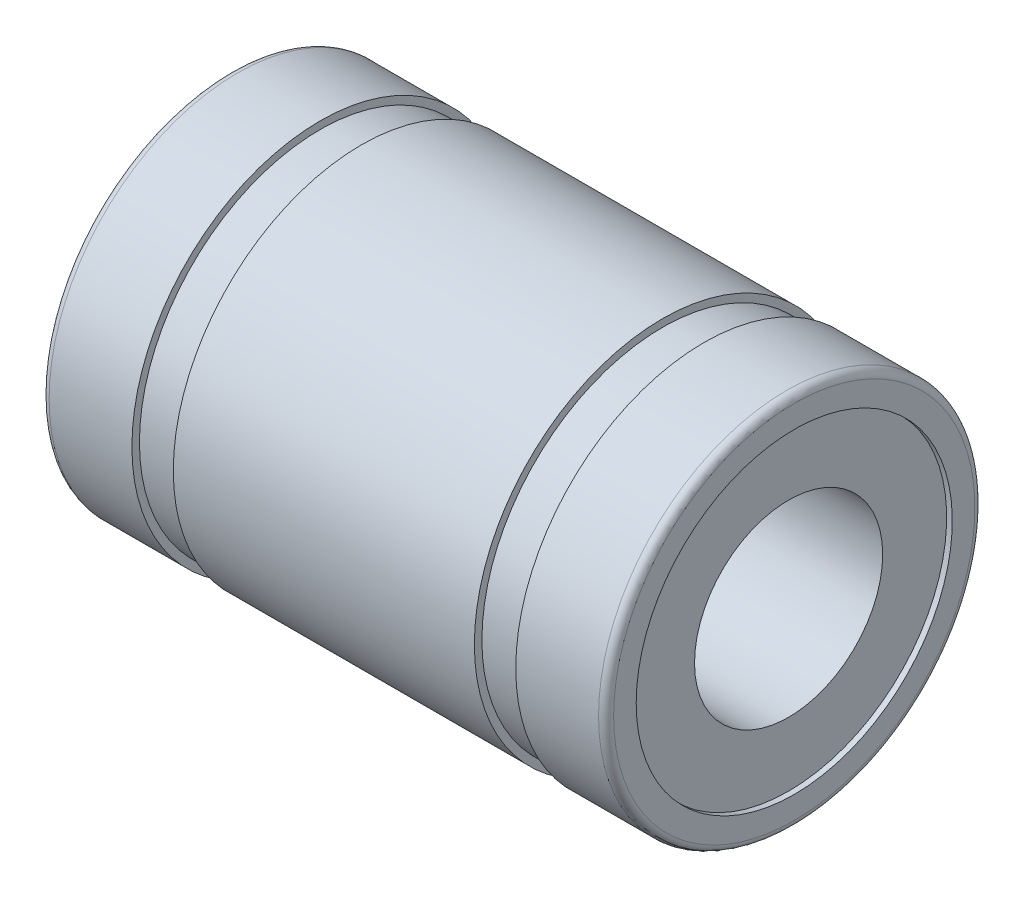
ISO-10303-21;
HEADER;
FILE_DESCRIPTION(('STEP AP214'),'2;1');
FILE_NAME('part.step','',(''),(''),'','','');
FILE_SCHEMA(('AUTOMOTIVE_DESIGN { 1 0 10303 214 1 1 1 1 }'));
ENDSEC;
DATA;
#1=APPLICATION_CONTEXT('core data for automotive mechanical design processes');
#2=APPLICATION_PROTOCOL_DEFINITION('international standard','automotive_design',2000,#1);
#3=PRODUCT_CONTEXT('',#1,'mechanical');
#4=PRODUCT('Part','Part','',(#3));
#5=PRODUCT_RELATED_PRODUCT_CATEGORY('part','',(#4));
#6=PRODUCT_DEFINITION_FORMATION('','',#4);
#7=PRODUCT_DEFINITION_CONTEXT('part definition',#1,'design');
#8=PRODUCT_DEFINITION('design','',#6,#7);
#9=PRODUCT_DEFINITION_SHAPE('','',#8);
#10=(LENGTH_UNIT() NAMED_UNIT(*) SI_UNIT(.MILLI.,.METRE.));
#11=(NAMED_UNIT(*) PLANE_ANGLE_UNIT() SI_UNIT($,.RADIAN.));
#12=(NAMED_UNIT(*) SI_UNIT($,.STERADIAN.) SOLID_ANGLE_UNIT());
#13=UNCERTAINTY_MEASURE_WITH_UNIT(LENGTH_MEASURE(1.E-05),#10,'distance_accuracy_value','');
#14=(GEOMETRIC_REPRESENTATION_CONTEXT(3) GLOBAL_UNCERTAINTY_ASSIGNED_CONTEXT((#13)) GLOBAL_UNIT_ASSIGNED_CONTEXT((#10,
#11,#12)) REPRESENTATION_CONTEXT('',''));
#15=CARTESIAN_POINT('',(0.,0.,0.));
#16=DIRECTION('',(0.,0.,1.));
#17=DIRECTION('',(1.,0.,0.));
#18=AXIS2_PLACEMENT_3D('',#15,#16,#17);
#19=CARTESIAN_POINT('',(-7.3,0.,0.));
#20=DIRECTION('',(-1.,0.,0.));
#21=DIRECTION('',(0.,0.,1.));
#22=AXIS2_PLACEMENT_3D('',#19,#20,#21);
#23=TOROIDAL_SURFACE('',#22,4.8,0.2);
#24=CARTESIAN_POINT('',(-7.5,0.,0.));
#25=DIRECTION('',(-1.,0.,0.));
#26=DIRECTION('',(0.,0.,1.));
#27=AXIS2_PLACEMENT_3D('',#24,#25,#26);
#28=CIRCLE('',#27,4.8);
#29=CARTESIAN_POINT('',(-7.5,0.,4.8));
#30=VERTEX_POINT('',#29);
#31=EDGE_CURVE('E10',#30,#30,#28,.T.);
#32=ORIENTED_EDGE('',*,*,#31,.F.);
#33=EDGE_LOOP('',(#32));
#34=FACE_BOUND('',#33,.T.);
#35=CARTESIAN_POINT('',(-7.3,0.,0.));
#36=DIRECTION('',(-1.,0.,0.));
#37=DIRECTION('',(0.,0.,1.));
#38=AXIS2_PLACEMENT_3D('',#35,#36,#37);
#39=CIRCLE('',#38,5.);
#40=CARTESIAN_POINT('',(-7.3,0.,5.));
#41=VERTEX_POINT('',#40);
#42=EDGE_CURVE('E39',#41,#41,#39,.T.);
#43=ORIENTED_EDGE('',*,*,#42,.T.);
#44=EDGE_LOOP('',(#43));
#45=FACE_BOUND('',#44,.T.);
#46=ADVANCED_FACE('F14',(#34,#45),#23,.T.);
#47=CARTESIAN_POINT('',(-7.5,4.8,0.));
#48=DIRECTION('',(1.,0.,0.));
#49=DIRECTION('',(0.,0.,-1.));
#50=AXIS2_PLACEMENT_3D('',#47,#48,#49);
#51=PLANE('',#50);
#52=CARTESIAN_POINT('',(-7.5,0.,0.));
#53=DIRECTION('',(1.,0.,0.));
#54=DIRECTION('',(0.,0.,-1.));
#55=AXIS2_PLACEMENT_3D('',#52,#53,#54);
#56=CIRCLE('',#55,4.2);
#57=CARTESIAN_POINT('',(-7.5,0.,-4.2));
#58=VERTEX_POINT('',#57);
#59=EDGE_CURVE('E40',#58,#58,#56,.T.);
#60=ORIENTED_EDGE('',*,*,#59,.T.);
#61=EDGE_LOOP('',(#60));
#62=FACE_BOUND('',#61,.T.);
#63=ORIENTED_EDGE('',*,*,#31,.T.);
#64=EDGE_LOOP('',(#63));
#65=FACE_BOUND('',#64,.T.);
#66=ADVANCED_FACE('F108',(#62,#65),#51,.F.);
#67=CARTESIAN_POINT('',(7.5,0.,0.));
#68=DIRECTION('',(-1.,0.,0.));
#69=DIRECTION('',(0.,0.,1.));
#70=AXIS2_PLACEMENT_3D('',#67,#68,#69);
#71=PLANE('',#70);
#72=CARTESIAN_POINT('',(7.5,0.,0.));
#73=DIRECTION('',(-1.,0.,0.));
#74=DIRECTION('',(0.,0.,1.));
#75=AXIS2_PLACEMENT_3D('',#72,#73,#74);
#76=CIRCLE('',#75,4.2);
#77=CARTESIAN_POINT('',(7.5,0.,4.2));
#78=VERTEX_POINT('',#77);
#79=EDGE_CURVE('E36',#78,#78,#76,.T.);
#80=ORIENTED_EDGE('',*,*,#79,.T.);
#81=EDGE_LOOP('',(#80));
#82=FACE_BOUND('',#81,.T.);
#83=CARTESIAN_POINT('',(7.5,0.,0.));
#84=DIRECTION('',(-1.,0.,0.));
#85=DIRECTION('',(0.,0.,1.));
#86=AXIS2_PLACEMENT_3D('',#83,#84,#85);
#87=CIRCLE('',#86,4.8);
#88=CARTESIAN_POINT('',(7.5,0.,4.8));
#89=VERTEX_POINT('',#88);
#90=EDGE_CURVE('E22',#89,#89,#87,.T.);
#91=ORIENTED_EDGE('',*,*,#90,.F.);
#92=EDGE_LOOP('',(#91));
#93=FACE_BOUND('',#92,.T.);
#94=ADVANCED_FACE('F103',(#82,#93),#71,.F.);
#95=CARTESIAN_POINT('',(7.3,0.,0.));
#96=DIRECTION('',(-1.,0.,0.));
#97=DIRECTION('',(0.,0.,1.));
#98=AXIS2_PLACEMENT_3D('',#95,#96,#97);
#99=TOROIDAL_SURFACE('',#98,4.8,0.2);
#100=CARTESIAN_POINT('',(7.3,0.,0.));
#101=DIRECTION('',(-1.,0.,0.));
#102=DIRECTION('',(0.,0.,1.));
#103=AXIS2_PLACEMENT_3D('',#100,#101,#102);
#104=CIRCLE('',#103,5.);
#105=CARTESIAN_POINT('',(7.3,0.,5.));
#106=VERTEX_POINT('',#105);
#107=EDGE_CURVE('E32',#106,#106,#104,.T.);
#108=ORIENTED_EDGE('',*,*,#107,.F.);
#109=EDGE_LOOP('',(#108));
#110=FACE_BOUND('',#109,.T.);
#111=ORIENTED_EDGE('',*,*,#90,.T.);
#112=EDGE_LOOP('',(#111));
#113=FACE_BOUND('',#112,.T.);
#114=ADVANCED_FACE('F100',(#110,#113),#99,.T.);
#115=CARTESIAN_POINT('',(0.,0.,0.));
#116=DIRECTION('',(-1.,0.,0.));
#117=DIRECTION('',(0.,0.,1.));
#118=AXIS2_PLACEMENT_3D('',#115,#116,#117);
#119=CYLINDRICAL_SURFACE('',#118,5.);
#120=CARTESIAN_POINT('',(5.1,0.,0.));
#121=DIRECTION('',(-1.,0.,0.));
#122=DIRECTION('',(0.,0.,1.));
#123=AXIS2_PLACEMENT_3D('',#120,#121,#122);
#124=CIRCLE('',#123,5.);
#125=CARTESIAN_POINT('',(5.1,0.,5.));
#126=VERTEX_POINT('',#125);
#127=EDGE_CURVE('E90',#126,#126,#124,.T.);
#128=ORIENTED_EDGE('',*,*,#127,.F.);
#129=EDGE_LOOP('',(#128));
#130=FACE_BOUND('',#129,.T.);
#131=ORIENTED_EDGE('',*,*,#107,.T.);
#132=EDGE_LOOP('',(#131));
#133=FACE_BOUND('',#132,.T.);
#134=ADVANCED_FACE('F98',(#130,#133),#119,.T.);
#135=CARTESIAN_POINT('',(5.1,4.8,0.));
#136=DIRECTION('',(-1.,0.,0.));
#137=DIRECTION('',(0.,0.,1.));
#138=AXIS2_PLACEMENT_3D('',#135,#136,#137);
#139=PLANE('',#138);
#140=ORIENTED_EDGE('',*,*,#127,.T.);
#141=EDGE_LOOP('',(#140));
#142=FACE_BOUND('',#141,.T.);
#143=CARTESIAN_POINT('',(5.1,0.,0.));
#144=DIRECTION('',(-1.,0.,0.));
#145=DIRECTION('',(0.,0.,1.));
#146=AXIS2_PLACEMENT_3D('',#143,#144,#145);
#147=CIRCLE('',#146,4.8);
#148=CARTESIAN_POINT('',(5.1,0.,4.8));
#149=VERTEX_POINT('',#148);
#150=EDGE_CURVE('E86',#149,#149,#147,.T.);
#151=ORIENTED_EDGE('',*,*,#150,.F.);
#152=EDGE_LOOP('',(#151));
#153=FACE_BOUND('',#152,.T.);
#154=ADVANCED_FACE('F156',(#142,#153),#139,.T.);
#155=CARTESIAN_POINT('',(0.,0.,0.));
#156=DIRECTION('',(-1.,0.,0.));
#157=DIRECTION('',(0.,0.,1.));
#158=AXIS2_PLACEMENT_3D('',#155,#156,#157);
#159=CYLINDRICAL_SURFACE('',#158,4.8);
#160=ORIENTED_EDGE('',*,*,#150,.T.);
#161=EDGE_LOOP('',(#160));
#162=FACE_BOUND('',#161,.T.);
#163=CARTESIAN_POINT('',(4.,0.,0.));
#164=DIRECTION('',(-1.,0.,0.));
#165=DIRECTION('',(0.,0.,1.));
#166=AXIS2_PLACEMENT_3D('',#163,#164,#165);
#167=CIRCLE('',#166,4.8);
#168=CARTESIAN_POINT('',(4.,0.,4.8));
#169=VERTEX_POINT('',#168);
#170=EDGE_CURVE('E82',#169,#169,#167,.T.);
#171=ORIENTED_EDGE('',*,*,#170,.F.);
#172=EDGE_LOOP('',(#171));
#173=FACE_BOUND('',#172,.T.);
#174=ADVANCED_FACE('F152',(#162,#173),#159,.T.);
#175=CARTESIAN_POINT('',(4.,5.,0.));
#176=DIRECTION('',(1.,0.,0.));
#177=DIRECTION('',(0.,0.,-1.));
#178=AXIS2_PLACEMENT_3D('',#175,#176,#177);
#179=PLANE('',#178);
#180=ORIENTED_EDGE('',*,*,#170,.T.);
#181=EDGE_LOOP('',(#180));
#182=FACE_BOUND('',#181,.T.);
#183=CARTESIAN_POINT('',(4.,0.,0.));
#184=DIRECTION('',(-1.,0.,0.));
#185=DIRECTION('',(0.,0.,1.));
#186=AXIS2_PLACEMENT_3D('',#183,#184,#185);
#187=CIRCLE('',#186,5.);
#188=CARTESIAN_POINT('',(4.,0.,5.));
#189=VERTEX_POINT('',#188);
#190=EDGE_CURVE('E78',#189,#189,#187,.T.);
#191=ORIENTED_EDGE('',*,*,#190,.F.);
#192=EDGE_LOOP('',(#191));
#193=FACE_BOUND('',#192,.T.);
#194=ADVANCED_FACE('F148',(#182,#193),#179,.T.);
#195=CARTESIAN_POINT('',(0.,0.,0.));
#196=DIRECTION('',(-1.,0.,0.));
#197=DIRECTION('',(0.,0.,1.));
#198=AXIS2_PLACEMENT_3D('',#195,#196,#197);
#199=CYLINDRICAL_SURFACE('',#198,5.);
#200=CARTESIAN_POINT('',(-4.,0.,0.));
#201=DIRECTION('',(-1.,0.,0.));
#202=DIRECTION('',(0.,0.,1.));
#203=AXIS2_PLACEMENT_3D('',#200,#201,#202);
#204=CIRCLE('',#203,5.);
#205=CARTESIAN_POINT('',(-4.,0.,5.));
#206=VERTEX_POINT('',#205);
#207=EDGE_CURVE('E74',#206,#206,#204,.T.);
#208=ORIENTED_EDGE('',*,*,#207,.F.);
#209=EDGE_LOOP('',(#208));
#210=FACE_BOUND('',#209,.T.);
#211=ORIENTED_EDGE('',*,*,#190,.T.);
#212=EDGE_LOOP('',(#211));
#213=FACE_BOUND('',#212,.T.);
#214=ADVANCED_FACE('F144',(#210,#213),#199,.T.);
#215=CARTESIAN_POINT('',(-4.,4.8,0.));
#216=DIRECTION('',(-1.,0.,0.));
#217=DIRECTION('',(0.,0.,1.));
#218=AXIS2_PLACEMENT_3D('',#215,#216,#217);
#219=PLANE('',#218);
#220=ORIENTED_EDGE('',*,*,#207,.T.);
#221=EDGE_LOOP('',(#220));
#222=FACE_BOUND('',#221,.T.);
#223=CARTESIAN_POINT('',(-4.,0.,0.));
#224=DIRECTION('',(-1.,0.,0.));
#225=DIRECTION('',(0.,0.,1.));
#226=AXIS2_PLACEMENT_3D('',#223,#224,#225);
#227=CIRCLE('',#226,4.8);
#228=CARTESIAN_POINT('',(-4.,0.,4.8));
#229=VERTEX_POINT('',#228);
#230=EDGE_CURVE('E70',#229,#229,#227,.T.);
#231=ORIENTED_EDGE('',*,*,#230,.F.);
#232=EDGE_LOOP('',(#231));
#233=FACE_BOUND('',#232,.T.);
#234=ADVANCED_FACE('F137',(#222,#233),#219,.T.);
#235=CARTESIAN_POINT('',(0.,0.,0.));
#236=DIRECTION('',(-1.,0.,0.));
#237=DIRECTION('',(0.,0.,1.));
#238=AXIS2_PLACEMENT_3D('',#235,#236,#237);
#239=CYLINDRICAL_SURFACE('',#238,4.8);
#240=ORIENTED_EDGE('',*,*,#230,.T.);
#241=EDGE_LOOP('',(#240));
#242=FACE_BOUND('',#241,.T.);
#243=CARTESIAN_POINT('',(-5.1,0.,0.));
#244=DIRECTION('',(-1.,0.,0.));
#245=DIRECTION('',(0.,0.,1.));
#246=AXIS2_PLACEMENT_3D('',#243,#244,#245);
#247=CIRCLE('',#246,4.8);
#248=CARTESIAN_POINT('',(-5.1,0.,4.8));
#249=VERTEX_POINT('',#248);
#250=EDGE_CURVE('E66',#249,#249,#247,.T.);
#251=ORIENTED_EDGE('',*,*,#250,.F.);
#252=EDGE_LOOP('',(#251));
#253=FACE_BOUND('',#252,.T.);
#254=ADVANCED_FACE('F131',(#242,#253),#239,.T.);
#255=CARTESIAN_POINT('',(-5.1,5.,0.));
#256=DIRECTION('',(1.,0.,0.));
#257=DIRECTION('',(0.,0.,-1.));
#258=AXIS2_PLACEMENT_3D('',#255,#256,#257);
#259=PLANE('',#258);
#260=ORIENTED_EDGE('',*,*,#250,.T.);
#261=EDGE_LOOP('',(#260));
#262=FACE_BOUND('',#261,.T.);
#263=CARTESIAN_POINT('',(-5.1,0.,0.));
#264=DIRECTION('',(-1.,0.,0.));
#265=DIRECTION('',(0.,0.,1.));
#266=AXIS2_PLACEMENT_3D('',#263,#264,#265);
#267=CIRCLE('',#266,5.);
#268=CARTESIAN_POINT('',(-5.1,0.,5.));
#269=VERTEX_POINT('',#268);
#270=EDGE_CURVE('E63',#269,#269,#267,.T.);
#271=ORIENTED_EDGE('',*,*,#270,.F.);
#272=EDGE_LOOP('',(#271));
#273=FACE_BOUND('',#272,.T.);
#274=ADVANCED_FACE('F126',(#262,#273),#259,.T.);
#275=CARTESIAN_POINT('',(0.,0.,0.));
#276=DIRECTION('',(-1.,0.,0.));
#277=DIRECTION('',(0.,0.,1.));
#278=AXIS2_PLACEMENT_3D('',#275,#276,#277);
#279=CYLINDRICAL_SURFACE('',#278,5.);
#280=ORIENTED_EDGE('',*,*,#42,.F.);
#281=EDGE_LOOP('',(#280));
#282=FACE_BOUND('',#281,.T.);
#283=ORIENTED_EDGE('',*,*,#270,.T.);
#284=EDGE_LOOP('',(#283));
#285=FACE_BOUND('',#284,.T.);
#286=ADVANCED_FACE('F122',(#282,#285),#279,.T.);
#287=CARTESIAN_POINT('',(6.75,0.,0.));
#288=DIRECTION('',(1.,0.,0.));
#289=DIRECTION('',(0.,-1.,0.));
#290=AXIS2_PLACEMENT_3D('',#287,#288,#289);
#291=CYLINDRICAL_SURFACE('',#290,4.2);
#292=CARTESIAN_POINT('',(7.35,0.,0.));
#293=DIRECTION('',(-1.,0.,0.));
#294=DIRECTION('',(0.,-1.,0.));
#295=AXIS2_PLACEMENT_3D('',#292,#293,#294);
#296=CIRCLE('',#295,4.2);
#297=CARTESIAN_POINT('',(7.35,-4.2,0.));
#298=VERTEX_POINT('',#297);
#299=EDGE_CURVE('E43',#298,#298,#296,.T.);
#300=ORIENTED_EDGE('',*,*,#299,.T.);
#301=EDGE_LOOP('',(#300));
#302=FACE_BOUND('',#301,.T.);
#303=ORIENTED_EDGE('',*,*,#79,.F.);
#304=EDGE_LOOP('',(#303));
#305=FACE_BOUND('',#304,.T.);
#306=ADVANCED_FACE('F125',(#302,#305),#291,.F.);
#307=CARTESIAN_POINT('',(-6.75,0.,0.));
#308=DIRECTION('',(-1.,0.,0.));
#309=DIRECTION('',(0.,-1.,0.));
#310=AXIS2_PLACEMENT_3D('',#307,#308,#309);
#311=CYLINDRICAL_SURFACE('',#310,4.2);
#312=CARTESIAN_POINT('',(-7.35,0.,0.));
#313=DIRECTION('',(1.,0.,0.));
#314=DIRECTION('',(0.,-1.,0.));
#315=AXIS2_PLACEMENT_3D('',#312,#313,#314);
#316=CIRCLE('',#315,4.2);
#317=CARTESIAN_POINT('',(-7.35,-4.2,0.));
#318=VERTEX_POINT('',#317);
#319=EDGE_CURVE('E49',#318,#318,#316,.T.);
#320=ORIENTED_EDGE('',*,*,#319,.T.);
#321=EDGE_LOOP('',(#320));
#322=FACE_BOUND('',#321,.T.);
#323=ORIENTED_EDGE('',*,*,#59,.F.);
#324=EDGE_LOOP('',(#323));
#325=FACE_BOUND('',#324,.T.);
#326=ADVANCED_FACE('F223',(#322,#325),#311,.F.);
#327=CARTESIAN_POINT('',(7.35,0.,0.));
#328=DIRECTION('',(1.,0.,0.));
#329=DIRECTION('',(0.,0.,-1.));
#330=AXIS2_PLACEMENT_3D('',#327,#328,#329);
#331=PLANE('',#330);
#332=CARTESIAN_POINT('',(7.35,0.,0.));
#333=DIRECTION('',(1.,0.,0.));
#334=DIRECTION('',(0.,0.,-1.));
#335=AXIS2_PLACEMENT_3D('',#332,#333,#334);
#336=CIRCLE('',#335,2.5);
#337=CARTESIAN_POINT('',(7.35,0.,-2.5));
#338=VERTEX_POINT('',#337);
#339=EDGE_CURVE('E57',#338,#338,#336,.T.);
#340=ORIENTED_EDGE('',*,*,#339,.F.);
#341=EDGE_LOOP('',(#340));
#342=FACE_BOUND('',#341,.T.);
#343=ORIENTED_EDGE('',*,*,#299,.F.);
#344=EDGE_LOOP('',(#343));
#345=FACE_BOUND('',#344,.T.);
#346=ADVANCED_FACE('F231',(#342,#345),#331,.T.);
#347=CARTESIAN_POINT('',(-7.35,0.,0.));
#348=DIRECTION('',(-1.,0.,0.));
#349=DIRECTION('',(0.,0.,1.));
#350=AXIS2_PLACEMENT_3D('',#347,#348,#349);
#351=PLANE('',#350);
#352=CARTESIAN_POINT('',(-7.35,0.,0.));
#353=DIRECTION('',(-1.,0.,0.));
#354=DIRECTION('',(0.,0.,1.));
#355=AXIS2_PLACEMENT_3D('',#352,#353,#354);
#356=CIRCLE('',#355,2.5);
#357=CARTESIAN_POINT('',(-7.35,0.,2.5));
#358=VERTEX_POINT('',#357);
#359=EDGE_CURVE('E17',#358,#358,#356,.T.);
#360=ORIENTED_EDGE('',*,*,#359,.F.);
#361=EDGE_LOOP('',(#360));
#362=FACE_BOUND('',#361,.T.);
#363=ORIENTED_EDGE('',*,*,#319,.F.);
#364=EDGE_LOOP('',(#363));
#365=FACE_BOUND('',#364,.T.);
#366=ADVANCED_FACE('F241',(#362,#365),#351,.T.);
#367=CARTESIAN_POINT('',(-15.,0.,0.));
#368=DIRECTION('',(1.,0.,0.));
#369=DIRECTION('',(0.,-1.,0.));
#370=AXIS2_PLACEMENT_3D('',#367,#368,#369);
#371=CYLINDRICAL_SURFACE('',#370,2.5);
#372=ORIENTED_EDGE('',*,*,#339,.T.);
#373=EDGE_LOOP('',(#372));
#374=FACE_BOUND('',#373,.T.);
#375=ORIENTED_EDGE('',*,*,#359,.T.);
#376=EDGE_LOOP('',(#375));
#377=FACE_BOUND('',#376,.T.);
#378=ADVANCED_FACE('F250',(#374,#377),#371,.F.);
#379=CLOSED_SHELL('',(#46,#66,#94,#114,#134,#154,#174,#194,#214,#234,#254,#274,#286,#306,#326,
#346,#366,#378));
#380=MANIFOLD_SOLID_BREP('B1',#379);
#381=ADVANCED_BREP_SHAPE_REPRESENTATION('',(#18,#380),#14);
#382=SHAPE_DEFINITION_REPRESENTATION(#9,#381);
ENDSEC;
END-ISO-10303-21;
